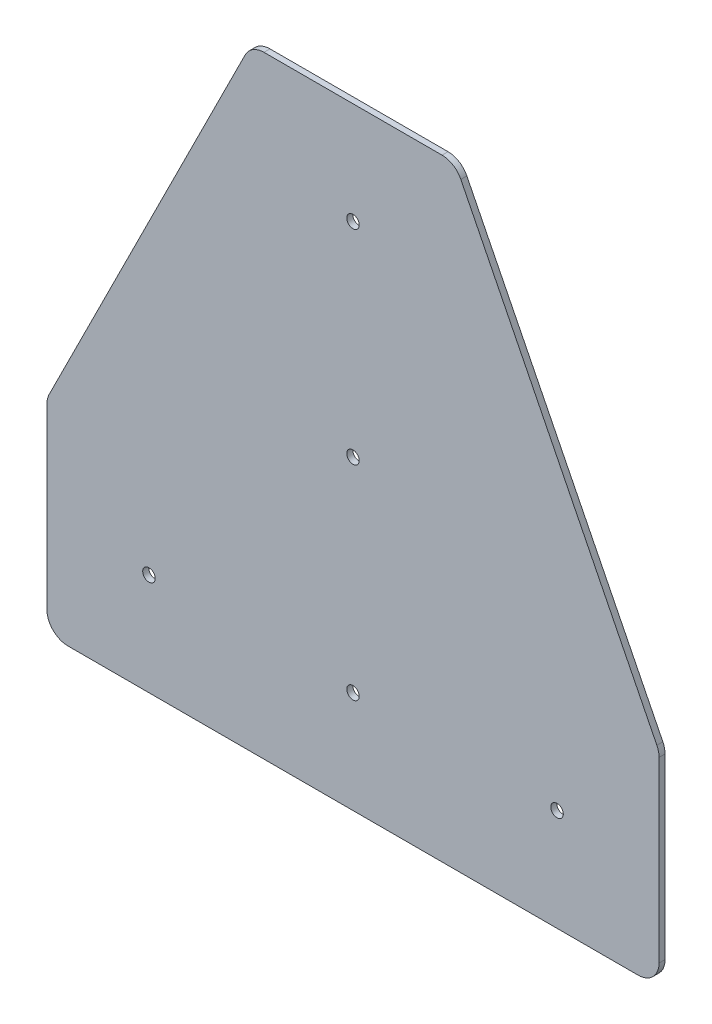
ISO-10303-21;
HEADER;
FILE_DESCRIPTION(('STEP AP214'),'2;1');
FILE_NAME('part.step','',(''),(''),'','','');
FILE_SCHEMA(('AUTOMOTIVE_DESIGN { 1 0 10303 214 1 1 1 1 }'));
ENDSEC;
DATA;
#1=APPLICATION_CONTEXT('core data for automotive mechanical design processes');
#2=APPLICATION_PROTOCOL_DEFINITION('international standard','automotive_design',2000,#1);
#3=PRODUCT_CONTEXT('',#1,'mechanical');
#4=PRODUCT('Part','Part','',(#3));
#5=PRODUCT_RELATED_PRODUCT_CATEGORY('part','',(#4));
#6=PRODUCT_DEFINITION_FORMATION('','',#4);
#7=PRODUCT_DEFINITION_CONTEXT('part definition',#1,'design');
#8=PRODUCT_DEFINITION('design','',#6,#7);
#9=PRODUCT_DEFINITION_SHAPE('','',#8);
#10=(LENGTH_UNIT() NAMED_UNIT(*) SI_UNIT(.MILLI.,.METRE.));
#11=(NAMED_UNIT(*) PLANE_ANGLE_UNIT() SI_UNIT($,.RADIAN.));
#12=(NAMED_UNIT(*) SI_UNIT($,.STERADIAN.) SOLID_ANGLE_UNIT());
#13=UNCERTAINTY_MEASURE_WITH_UNIT(LENGTH_MEASURE(1.E-05),#10,'distance_accuracy_value','');
#14=(GEOMETRIC_REPRESENTATION_CONTEXT(3) GLOBAL_UNCERTAINTY_ASSIGNED_CONTEXT((#13)) GLOBAL_UNIT_ASSIGNED_CONTEXT((#10,
#11,#12)) REPRESENTATION_CONTEXT('',''));
#15=CARTESIAN_POINT('',(0.,0.,0.));
#16=DIRECTION('',(0.,0.,1.));
#17=DIRECTION('',(1.,0.,0.));
#18=AXIS2_PLACEMENT_3D('',#15,#16,#17);
#19=CARTESIAN_POINT('',(-75.40625,0.,0.));
#20=DIRECTION('',(0.,1.,0.));
#21=DIRECTION('',(0.,0.,1.));
#22=AXIS2_PLACEMENT_3D('',#19,#20,#21);
#23=PLANE('',#22);
#24=DIRECTION('',(0.,0.,-1.));
#25=VECTOR('',#24,1.);
#26=CARTESIAN_POINT('',(75.4062500021374,0.,0.79375));
#27=LINE('',#26,#25);
#28=CARTESIAN_POINT('',(75.4062500010687,0.,0.));
#29=VERTEX_POINT('',#28);
#30=CARTESIAN_POINT('',(75.4062500010687,0.,1.5875));
#31=VERTEX_POINT('',#30);
#32=EDGE_CURVE('E160',#29,#31,#27,.F.);
#33=ORIENTED_EDGE('',*,*,#32,.T.);
#34=DIRECTION('',(1.,0.,0.));
#35=VECTOR('',#34,1.);
#36=CARTESIAN_POINT('',(0.,0.,1.5875));
#37=LINE('',#36,#35);
#38=CARTESIAN_POINT('',(-75.4062499989313,0.,1.5875));
#39=VERTEX_POINT('',#38);
#40=EDGE_CURVE('E194',#39,#31,#37,.T.);
#41=ORIENTED_EDGE('',*,*,#40,.F.);
#42=DIRECTION('',(0.,0.,1.));
#43=VECTOR('',#42,1.);
#44=CARTESIAN_POINT('',(-75.4062499978626,0.,0.79375));
#45=LINE('',#44,#43);
#46=CARTESIAN_POINT('',(-75.4062499989313,0.,0.));
#47=VERTEX_POINT('',#46);
#48=EDGE_CURVE('E130',#39,#47,#45,.F.);
#49=ORIENTED_EDGE('',*,*,#48,.T.);
#50=DIRECTION('',(1.,0.,0.));
#51=VECTOR('',#50,1.);
#52=CARTESIAN_POINT('',(0.,0.,0.));
#53=LINE('',#52,#51);
#54=EDGE_CURVE('E211',#47,#29,#53,.T.);
#55=ORIENTED_EDGE('',*,*,#54,.T.);
#56=EDGE_LOOP('',(#33,#41,#49,#55));
#57=FACE_BOUND('',#56,.T.);
#58=ADVANCED_FACE('F16',(#57),#23,.F.);
#59=CARTESIAN_POINT('',(75.40625,5.55625,1.5875));
#60=DIRECTION('',(0.,0.,-1.));
#61=DIRECTION('',(0.,1.,0.));
#62=AXIS2_PLACEMENT_3D('',#59,#60,#61);
#63=CYLINDRICAL_SURFACE('',#62,5.55625);
#64=ORIENTED_EDGE('',*,*,#32,.F.);
#65=CARTESIAN_POINT('',(75.40625,5.55625,0.));
#66=DIRECTION('',(0.,0.,-1.));
#67=DIRECTION('',(0.,1.,0.));
#68=AXIS2_PLACEMENT_3D('',#65,#66,#67);
#69=CIRCLE('',#68,5.55625);
#70=CARTESIAN_POINT('',(80.9625,5.55625,0.));
#71=VERTEX_POINT('',#70);
#72=EDGE_CURVE('E208',#29,#71,#69,.F.);
#73=ORIENTED_EDGE('',*,*,#72,.T.);
#74=DIRECTION('',(0.,0.,1.));
#75=VECTOR('',#74,1.);
#76=CARTESIAN_POINT('',(80.9625,5.55625,0.79375));
#77=LINE('',#76,#75);
#78=CARTESIAN_POINT('',(80.9625,5.55625,1.5875));
#79=VERTEX_POINT('',#78);
#80=EDGE_CURVE('E157',#71,#79,#77,.T.);
#81=ORIENTED_EDGE('',*,*,#80,.T.);
#82=CARTESIAN_POINT('',(75.40625,5.55625,1.5875));
#83=DIRECTION('',(0.,0.,-1.));
#84=DIRECTION('',(0.,1.,0.));
#85=AXIS2_PLACEMENT_3D('',#82,#83,#84);
#86=CIRCLE('',#85,5.55625);
#87=EDGE_CURVE('E192',#31,#79,#86,.F.);
#88=ORIENTED_EDGE('',*,*,#87,.F.);
#89=EDGE_LOOP('',(#64,#73,#81,#88));
#90=FACE_BOUND('',#89,.T.);
#91=ADVANCED_FACE('F301',(#90),#63,.T.);
#92=CARTESIAN_POINT('',(80.9625,5.55625,0.));
#93=DIRECTION('',(-1.,0.,0.));
#94=DIRECTION('',(0.,0.,1.));
#95=AXIS2_PLACEMENT_3D('',#92,#93,#94);
#96=PLANE('',#95);
#97=ORIENTED_EDGE('',*,*,#80,.F.);
#98=DIRECTION('',(0.,1.,0.));
#99=VECTOR('',#98,1.);
#100=CARTESIAN_POINT('',(80.9625,80.9625,0.));
#101=LINE('',#100,#99);
#102=CARTESIAN_POINT('',(80.9625,52.6633473008604,0.));
#103=VERTEX_POINT('',#102);
#104=EDGE_CURVE('E207',#71,#103,#101,.T.);
#105=ORIENTED_EDGE('',*,*,#104,.T.);
#106=DIRECTION('',(0.,0.,-1.));
#107=VECTOR('',#106,1.);
#108=CARTESIAN_POINT('',(80.9625,52.6633472997208,0.79375));
#109=LINE('',#108,#107);
#110=CARTESIAN_POINT('',(80.9625,52.6633473008604,1.5875));
#111=VERTEX_POINT('',#110);
#112=EDGE_CURVE('E104',#103,#111,#109,.F.);
#113=ORIENTED_EDGE('',*,*,#112,.T.);
#114=DIRECTION('',(0.,1.,0.));
#115=VECTOR('',#114,1.);
#116=CARTESIAN_POINT('',(80.9625,80.9625,1.5875));
#117=LINE('',#116,#115);
#118=EDGE_CURVE('E191',#79,#111,#117,.T.);
#119=ORIENTED_EDGE('',*,*,#118,.F.);
#120=EDGE_LOOP('',(#97,#105,#113,#119));
#121=FACE_BOUND('',#120,.T.);
#122=ADVANCED_FACE('F300',(#121),#96,.F.);
#123=CARTESIAN_POINT('',(75.40625,52.663347302,1.5875));
#124=DIRECTION('',(0.,0.,-1.));
#125=DIRECTION('',(0.,1.,0.));
#126=AXIS2_PLACEMENT_3D('',#123,#124,#125);
#127=CYLINDRICAL_SURFACE('',#126,5.55625);
#128=ORIENTED_EDGE('',*,*,#112,.F.);
#129=CARTESIAN_POINT('',(75.40625,52.663347302,0.));
#130=DIRECTION('',(0.,0.,-1.));
#131=DIRECTION('',(0.,1.,0.));
#132=AXIS2_PLACEMENT_3D('',#129,#130,#131);
#133=CIRCLE('',#132,5.55625);
#134=CARTESIAN_POINT('',(80.3759110792,55.1481778416,0.));
#135=VERTEX_POINT('',#134);
#136=EDGE_CURVE('E20',#103,#135,#133,.F.);
#137=ORIENTED_EDGE('',*,*,#136,.T.);
#138=DIRECTION('',(0.,0.,1.));
#139=VECTOR('',#138,1.);
#140=CARTESIAN_POINT('',(80.3759110792,55.1481778416,0.79375));
#141=LINE('',#140,#139);
#142=CARTESIAN_POINT('',(80.3759111000141,55.1481778539469,1.5875));
#143=VERTEX_POINT('',#142);
#144=EDGE_CURVE('E111',#135,#143,#141,.T.);
#145=ORIENTED_EDGE('',*,*,#144,.T.);
#146=CARTESIAN_POINT('',(75.40625,52.663347302,1.5875));
#147=DIRECTION('',(0.,0.,-1.));
#148=DIRECTION('',(0.,1.,0.));
#149=AXIS2_PLACEMENT_3D('',#146,#147,#148);
#150=CIRCLE('',#149,5.55625);
#151=EDGE_CURVE('E189',#111,#143,#150,.F.);
#152=ORIENTED_EDGE('',*,*,#151,.F.);
#153=EDGE_LOOP('',(#128,#137,#145,#152));
#154=FACE_BOUND('',#153,.T.);
#155=ADVANCED_FACE('F128',(#154),#127,.T.);
#156=CARTESIAN_POINT('',(28.5232097302,158.8535805396,0.));
#157=DIRECTION('',(-0.894427190999916,-0.447213595499958,0.));
#158=DIRECTION('',(0.447213595499958,-0.894427190999916,0.));
#159=AXIS2_PLACEMENT_3D('',#156,#157,#158);
#160=PLANE('',#159);
#161=ORIENTED_EDGE('',*,*,#144,.F.);
#162=DIRECTION('',(0.447213595499958,-0.894427190999916,0.));
#163=VECTOR('',#162,1.);
#164=CARTESIAN_POINT('',(28.5232097302,158.8535805396,0.));
#165=LINE('',#164,#163);
#166=CARTESIAN_POINT('',(28.5232097311073,158.853580538777,0.));
#167=VERTEX_POINT('',#166);
#168=EDGE_CURVE('E115',#135,#167,#165,.F.);
#169=ORIENTED_EDGE('',*,*,#168,.T.);
#170=DIRECTION('',(0.,0.,-1.));
#171=VECTOR('',#170,1.);
#172=CARTESIAN_POINT('',(28.5232097320146,158.853580537954,0.79375));
#173=LINE('',#172,#171);
#174=CARTESIAN_POINT('',(28.5232097195363,158.853580534931,1.5875));
#175=VERTEX_POINT('',#174);
#176=EDGE_CURVE('E117',#167,#175,#173,.F.);
#177=ORIENTED_EDGE('',*,*,#176,.T.);
#178=DIRECTION('',(-0.447213596058579,0.894427190720605,0.));
#179=VECTOR('',#178,1.);
#180=CARTESIAN_POINT('',(80.3759111427,55.14817782255,1.5875));
#181=LINE('',#180,#179);
#182=EDGE_CURVE('E116',#143,#175,#181,.T.);
#183=ORIENTED_EDGE('',*,*,#182,.F.);
#184=EDGE_LOOP('',(#161,#169,#177,#183));
#185=FACE_BOUND('',#184,.T.);
#186=ADVANCED_FACE('F113',(#185),#160,.F.);
#187=CARTESIAN_POINT('',(23.553548651,156.36875,1.5875));
#188=DIRECTION('',(0.,0.,-1.));
#189=DIRECTION('',(0.,1.,0.));
#190=AXIS2_PLACEMENT_3D('',#187,#188,#189);
#191=CYLINDRICAL_SURFACE('',#190,5.55625);
#192=ORIENTED_EDGE('',*,*,#176,.F.);
#193=CARTESIAN_POINT('',(23.553548651,156.36875,0.));
#194=DIRECTION('',(0.,0.,-1.));
#195=DIRECTION('',(0.,1.,0.));
#196=AXIS2_PLACEMENT_3D('',#193,#194,#195);
#197=CIRCLE('',#196,5.55625);
#198=CARTESIAN_POINT('',(23.553548651,161.925,0.));
#199=VERTEX_POINT('',#198);
#200=EDGE_CURVE('E127',#167,#199,#197,.F.);
#201=ORIENTED_EDGE('',*,*,#200,.T.);
#202=DIRECTION('',(0.,0.,1.));
#203=VECTOR('',#202,1.);
#204=CARTESIAN_POINT('',(23.553548651,161.925,0.79375));
#205=LINE('',#204,#203);
#206=CARTESIAN_POINT('',(23.553548651,161.925,1.5875));
#207=VERTEX_POINT('',#206);
#208=EDGE_CURVE('E152',#199,#207,#205,.T.);
#209=ORIENTED_EDGE('',*,*,#208,.T.);
#210=CARTESIAN_POINT('',(23.553548651,156.36875,1.5875));
#211=DIRECTION('',(0.,0.,-1.));
#212=DIRECTION('',(0.,1.,0.));
#213=AXIS2_PLACEMENT_3D('',#210,#211,#212);
#214=CIRCLE('',#213,5.55625);
#215=EDGE_CURVE('E186',#175,#207,#214,.F.);
#216=ORIENTED_EDGE('',*,*,#215,.F.);
#217=EDGE_LOOP('',(#192,#201,#209,#216));
#218=FACE_BOUND('',#217,.T.);
#219=ADVANCED_FACE('F295',(#218),#191,.T.);
#220=CARTESIAN_POINT('',(-23.553548651,161.925,1.5875));
#221=DIRECTION('',(0.,-1.,0.));
#222=DIRECTION('',(0.,0.,-1.));
#223=AXIS2_PLACEMENT_3D('',#220,#221,#222);
#224=PLANE('',#223);
#225=ORIENTED_EDGE('',*,*,#208,.F.);
#226=DIRECTION('',(-1.,0.,0.));
#227=VECTOR('',#226,1.);
#228=CARTESIAN_POINT('',(0.,161.925,0.));
#229=LINE('',#228,#227);
#230=CARTESIAN_POINT('',(-23.5535486504302,161.925,0.));
#231=VERTEX_POINT('',#230);
#232=EDGE_CURVE('E138',#199,#231,#229,.T.);
#233=ORIENTED_EDGE('',*,*,#232,.T.);
#234=DIRECTION('',(0.,0.,-1.));
#235=VECTOR('',#234,1.);
#236=CARTESIAN_POINT('',(-23.5535486498604,161.925,0.79375));
#237=LINE('',#236,#235);
#238=CARTESIAN_POINT('',(-23.5535486504302,161.925,1.5875));
#239=VERTEX_POINT('',#238);
#240=EDGE_CURVE('E149',#231,#239,#237,.F.);
#241=ORIENTED_EDGE('',*,*,#240,.T.);
#242=DIRECTION('',(-1.,0.,0.));
#243=VECTOR('',#242,1.);
#244=CARTESIAN_POINT('',(0.,161.925,1.5875));
#245=LINE('',#244,#243);
#246=EDGE_CURVE('E185',#207,#239,#245,.T.);
#247=ORIENTED_EDGE('',*,*,#246,.F.);
#248=EDGE_LOOP('',(#225,#233,#241,#247));
#249=FACE_BOUND('',#248,.T.);
#250=ADVANCED_FACE('F228',(#249),#224,.F.);
#251=CARTESIAN_POINT('',(-23.553548651,156.36875,1.5875));
#252=DIRECTION('',(0.,0.,-1.));
#253=DIRECTION('',(0.,1.,0.));
#254=AXIS2_PLACEMENT_3D('',#251,#252,#253);
#255=CYLINDRICAL_SURFACE('',#254,5.55625000000001);
#256=ORIENTED_EDGE('',*,*,#240,.F.);
#257=CARTESIAN_POINT('',(-23.553548651,156.36875,0.));
#258=DIRECTION('',(0.,0.,-1.));
#259=DIRECTION('',(0.,1.,0.));
#260=AXIS2_PLACEMENT_3D('',#257,#258,#259);
#261=CIRCLE('',#260,5.55625000000001);
#262=CARTESIAN_POINT('',(-28.5232097302,158.8535805396,0.));
#263=VERTEX_POINT('',#262);
#264=EDGE_CURVE('E222',#231,#263,#261,.F.);
#265=ORIENTED_EDGE('',*,*,#264,.T.);
#266=DIRECTION('',(0.,0.,1.));
#267=VECTOR('',#266,1.);
#268=CARTESIAN_POINT('',(-28.5232097302,158.8535805396,0.79375));
#269=LINE('',#268,#267);
#270=CARTESIAN_POINT('',(-28.523209718629,158.853580535754,1.5875));
#271=VERTEX_POINT('',#270);
#272=EDGE_CURVE('E146',#263,#271,#269,.T.);
#273=ORIENTED_EDGE('',*,*,#272,.T.);
#274=CARTESIAN_POINT('',(-23.553548651,156.36875,1.5875));
#275=DIRECTION('',(0.,0.,-1.));
#276=DIRECTION('',(0.,1.,0.));
#277=AXIS2_PLACEMENT_3D('',#274,#275,#276);
#278=CIRCLE('',#277,5.55625000000001);
#279=EDGE_CURVE('E183',#239,#271,#278,.F.);
#280=ORIENTED_EDGE('',*,*,#279,.F.);
#281=EDGE_LOOP('',(#256,#265,#273,#280));
#282=FACE_BOUND('',#281,.T.);
#283=ADVANCED_FACE('F235',(#282),#255,.T.);
#284=CARTESIAN_POINT('',(-80.3759110792,55.1481778416,0.));
#285=DIRECTION('',(0.894427190999916,-0.447213595499958,0.));
#286=DIRECTION('',(0.447213595499958,0.894427190999916,0.));
#287=AXIS2_PLACEMENT_3D('',#284,#285,#286);
#288=PLANE('',#287);
#289=ORIENTED_EDGE('',*,*,#272,.F.);
#290=DIRECTION('',(0.447213595499958,0.894427190999916,0.));
#291=VECTOR('',#290,1.);
#292=CARTESIAN_POINT('',(-80.3759110792,55.1481778416,0.));
#293=LINE('',#292,#291);
#294=CARTESIAN_POINT('',(-80.3759110795977,55.1481778417963,0.));
#295=VERTEX_POINT('',#294);
#296=EDGE_CURVE('E219',#263,#295,#293,.F.);
#297=ORIENTED_EDGE('',*,*,#296,.T.);
#298=DIRECTION('',(0.,0.,-1.));
#299=VECTOR('',#298,1.);
#300=CARTESIAN_POINT('',(-80.3759110799953,55.1481778419926,0.79375));
#301=LINE('',#300,#299);
#302=CARTESIAN_POINT('',(-80.3759111004117,55.1481778541432,1.5875));
#303=VERTEX_POINT('',#302);
#304=EDGE_CURVE('E143',#295,#303,#301,.F.);
#305=ORIENTED_EDGE('',*,*,#304,.T.);
#306=DIRECTION('',(-0.44721359605858,-0.894427190720605,0.));
#307=VECTOR('',#306,1.);
#308=CARTESIAN_POINT('',(-28.523209707975,158.853580530075,1.5875));
#309=LINE('',#308,#307);
#310=EDGE_CURVE('E181',#271,#303,#309,.T.);
#311=ORIENTED_EDGE('',*,*,#310,.F.);
#312=EDGE_LOOP('',(#289,#297,#305,#311));
#313=FACE_BOUND('',#312,.T.);
#314=ADVANCED_FACE('F253',(#313),#288,.F.);
#315=CARTESIAN_POINT('',(-75.40625,52.663347302,1.5875));
#316=DIRECTION('',(0.,0.,-1.));
#317=DIRECTION('',(0.,1.,0.));
#318=AXIS2_PLACEMENT_3D('',#315,#316,#317);
#319=CYLINDRICAL_SURFACE('',#318,5.55625000000001);
#320=ORIENTED_EDGE('',*,*,#304,.F.);
#321=CARTESIAN_POINT('',(-75.40625,52.663347302,0.));
#322=DIRECTION('',(0.,0.,-1.));
#323=DIRECTION('',(0.,1.,0.));
#324=AXIS2_PLACEMENT_3D('',#321,#322,#323);
#325=CIRCLE('',#324,5.55625000000001);
#326=CARTESIAN_POINT('',(-80.9625,52.663347302,0.));
#327=VERTEX_POINT('',#326);
#328=EDGE_CURVE('E216',#295,#327,#325,.F.);
#329=ORIENTED_EDGE('',*,*,#328,.T.);
#330=DIRECTION('',(0.,0.,1.));
#331=VECTOR('',#330,1.);
#332=CARTESIAN_POINT('',(-80.9625,52.663347302,0.79375));
#333=LINE('',#332,#331);
#334=CARTESIAN_POINT('',(-80.9625,52.663347302,1.5875));
#335=VERTEX_POINT('',#334);
#336=EDGE_CURVE('E135',#327,#335,#333,.T.);
#337=ORIENTED_EDGE('',*,*,#336,.T.);
#338=CARTESIAN_POINT('',(-75.40625,52.663347302,1.5875));
#339=DIRECTION('',(0.,0.,-1.));
#340=DIRECTION('',(0.,1.,0.));
#341=AXIS2_PLACEMENT_3D('',#338,#339,#340);
#342=CIRCLE('',#341,5.55625000000001);
#343=EDGE_CURVE('E179',#303,#335,#342,.F.);
#344=ORIENTED_EDGE('',*,*,#343,.F.);
#345=EDGE_LOOP('',(#320,#329,#337,#344));
#346=FACE_BOUND('',#345,.T.);
#347=ADVANCED_FACE('F250',(#346),#319,.T.);
#348=CARTESIAN_POINT('',(-80.9625,5.55625,1.5875));
#349=DIRECTION('',(1.,0.,0.));
#350=DIRECTION('',(0.,0.,-1.));
#351=AXIS2_PLACEMENT_3D('',#348,#349,#350);
#352=PLANE('',#351);
#353=DIRECTION('',(0.,0.,-1.));
#354=VECTOR('',#353,1.);
#355=CARTESIAN_POINT('',(-80.9625,5.55624999900217,0.79375));
#356=LINE('',#355,#354);
#357=CARTESIAN_POINT('',(-80.9625,5.55624999950109,0.));
#358=VERTEX_POINT('',#357);
#359=CARTESIAN_POINT('',(-80.9625,5.55624999950109,1.5875));
#360=VERTEX_POINT('',#359);
#361=EDGE_CURVE('E129',#358,#360,#356,.F.);
#362=ORIENTED_EDGE('',*,*,#361,.T.);
#363=DIRECTION('',(0.,-1.,0.));
#364=VECTOR('',#363,1.);
#365=CARTESIAN_POINT('',(-80.9625,80.9625,1.5875));
#366=LINE('',#365,#364);
#367=EDGE_CURVE('E35',#335,#360,#366,.T.);
#368=ORIENTED_EDGE('',*,*,#367,.F.);
#369=ORIENTED_EDGE('',*,*,#336,.F.);
#370=DIRECTION('',(0.,-1.,0.));
#371=VECTOR('',#370,1.);
#372=CARTESIAN_POINT('',(-80.9625,80.9625,0.));
#373=LINE('',#372,#371);
#374=EDGE_CURVE('E215',#327,#358,#373,.T.);
#375=ORIENTED_EDGE('',*,*,#374,.T.);
#376=EDGE_LOOP('',(#362,#368,#369,#375));
#377=FACE_BOUND('',#376,.T.);
#378=ADVANCED_FACE('F246',(#377),#352,.F.);
#379=CARTESIAN_POINT('',(-75.40625,5.55625,1.5875));
#380=DIRECTION('',(0.,0.,-1.));
#381=DIRECTION('',(0.,1.,0.));
#382=AXIS2_PLACEMENT_3D('',#379,#380,#381);
#383=CYLINDRICAL_SURFACE('',#382,5.55625000000001);
#384=ORIENTED_EDGE('',*,*,#361,.F.);
#385=CARTESIAN_POINT('',(-75.40625,5.55625,0.));
#386=DIRECTION('',(0.,0.,-1.));
#387=DIRECTION('',(0.,1.,0.));
#388=AXIS2_PLACEMENT_3D('',#385,#386,#387);
#389=CIRCLE('',#388,5.55625000000001);
#390=EDGE_CURVE('E212',#358,#47,#389,.F.);
#391=ORIENTED_EDGE('',*,*,#390,.T.);
#392=ORIENTED_EDGE('',*,*,#48,.F.);
#393=CARTESIAN_POINT('',(-75.40625,5.55625,1.5875));
#394=DIRECTION('',(0.,0.,-1.));
#395=DIRECTION('',(0.,1.,0.));
#396=AXIS2_PLACEMENT_3D('',#393,#394,#395);
#397=CIRCLE('',#396,5.55625000000001);
#398=EDGE_CURVE('E177',#360,#39,#397,.F.);
#399=ORIENTED_EDGE('',*,*,#398,.F.);
#400=EDGE_LOOP('',(#384,#391,#392,#399));
#401=FACE_BOUND('',#400,.T.);
#402=ADVANCED_FACE('F290',(#401),#383,.T.);
#403=CARTESIAN_POINT('',(-53.975,26.9875,0.));
#404=DIRECTION('',(0.,0.,1.));
#405=DIRECTION('',(1.,0.,0.));
#406=AXIS2_PLACEMENT_3D('',#403,#404,#405);
#407=CYLINDRICAL_SURFACE('',#406,1.65099999999999);
#408=CARTESIAN_POINT('',(-53.975,26.9875,1.5875));
#409=DIRECTION('',(0.,0.,1.));
#410=DIRECTION('',(1.,0.,0.));
#411=AXIS2_PLACEMENT_3D('',#408,#409,#410);
#412=CIRCLE('',#411,1.65099999999999);
#413=CARTESIAN_POINT('',(-52.324,26.9875,1.5875));
#414=VERTEX_POINT('',#413);
#415=EDGE_CURVE('E174',#414,#414,#412,.F.);
#416=ORIENTED_EDGE('',*,*,#415,.F.);
#417=EDGE_LOOP('',(#416));
#418=FACE_BOUND('',#417,.T.);
#419=CARTESIAN_POINT('',(-53.975,26.9875,0.));
#420=DIRECTION('',(0.,0.,1.));
#421=DIRECTION('',(1.,0.,0.));
#422=AXIS2_PLACEMENT_3D('',#419,#420,#421);
#423=CIRCLE('',#422,1.65099999999999);
#424=CARTESIAN_POINT('',(-52.324,26.9875,0.));
#425=VERTEX_POINT('',#424);
#426=EDGE_CURVE('E204',#425,#425,#423,.F.);
#427=ORIENTED_EDGE('',*,*,#426,.T.);
#428=EDGE_LOOP('',(#427));
#429=FACE_BOUND('',#428,.T.);
#430=ADVANCED_FACE('F286',(#418,#429),#407,.F.);
#431=CARTESIAN_POINT('',(53.975,26.9875,0.));
#432=DIRECTION('',(0.,0.,1.));
#433=DIRECTION('',(1.,0.,0.));
#434=AXIS2_PLACEMENT_3D('',#431,#432,#433);
#435=CYLINDRICAL_SURFACE('',#434,1.651);
#436=CARTESIAN_POINT('',(53.975,26.9875,1.5875));
#437=DIRECTION('',(0.,0.,1.));
#438=DIRECTION('',(1.,0.,0.));
#439=AXIS2_PLACEMENT_3D('',#436,#437,#438);
#440=CIRCLE('',#439,1.651);
#441=CARTESIAN_POINT('',(55.626,26.9875,1.5875));
#442=VERTEX_POINT('',#441);
#443=EDGE_CURVE('E171',#442,#442,#440,.F.);
#444=ORIENTED_EDGE('',*,*,#443,.F.);
#445=EDGE_LOOP('',(#444));
#446=FACE_BOUND('',#445,.T.);
#447=CARTESIAN_POINT('',(53.975,26.9875,0.));
#448=DIRECTION('',(0.,0.,1.));
#449=DIRECTION('',(1.,0.,0.));
#450=AXIS2_PLACEMENT_3D('',#447,#448,#449);
#451=CIRCLE('',#450,1.651);
#452=CARTESIAN_POINT('',(55.626,26.9875,0.));
#453=VERTEX_POINT('',#452);
#454=EDGE_CURVE('E201',#453,#453,#451,.F.);
#455=ORIENTED_EDGE('',*,*,#454,.T.);
#456=EDGE_LOOP('',(#455));
#457=FACE_BOUND('',#456,.T.);
#458=ADVANCED_FACE('F282',(#446,#457),#435,.F.);
#459=CARTESIAN_POINT('',(0.,26.9875,0.));
#460=DIRECTION('',(0.,0.,1.));
#461=DIRECTION('',(1.,0.,0.));
#462=AXIS2_PLACEMENT_3D('',#459,#460,#461);
#463=CYLINDRICAL_SURFACE('',#462,1.651);
#464=CARTESIAN_POINT('',(0.,26.9875,1.5875));
#465=DIRECTION('',(0.,0.,1.));
#466=DIRECTION('',(1.,0.,0.));
#467=AXIS2_PLACEMENT_3D('',#464,#465,#466);
#468=CIRCLE('',#467,1.651);
#469=CARTESIAN_POINT('',(1.651,26.9875,1.5875));
#470=VERTEX_POINT('',#469);
#471=EDGE_CURVE('E168',#470,#470,#468,.F.);
#472=ORIENTED_EDGE('',*,*,#471,.F.);
#473=EDGE_LOOP('',(#472));
#474=FACE_BOUND('',#473,.T.);
#475=CARTESIAN_POINT('',(0.,26.9875,0.));
#476=DIRECTION('',(0.,0.,1.));
#477=DIRECTION('',(1.,0.,0.));
#478=AXIS2_PLACEMENT_3D('',#475,#476,#477);
#479=CIRCLE('',#478,1.651);
#480=CARTESIAN_POINT('',(1.651,26.9875,0.));
#481=VERTEX_POINT('',#480);
#482=EDGE_CURVE('E198',#481,#481,#479,.F.);
#483=ORIENTED_EDGE('',*,*,#482,.T.);
#484=EDGE_LOOP('',(#483));
#485=FACE_BOUND('',#484,.T.);
#486=ADVANCED_FACE('F278',(#474,#485),#463,.F.);
#487=CARTESIAN_POINT('',(0.,134.9375,0.));
#488=DIRECTION('',(0.,0.,1.));
#489=DIRECTION('',(1.,0.,0.));
#490=AXIS2_PLACEMENT_3D('',#487,#488,#489);
#491=CYLINDRICAL_SURFACE('',#490,1.651);
#492=CARTESIAN_POINT('',(0.,134.9375,1.5875));
#493=DIRECTION('',(0.,0.,1.));
#494=DIRECTION('',(1.,0.,0.));
#495=AXIS2_PLACEMENT_3D('',#492,#493,#494);
#496=CIRCLE('',#495,1.651);
#497=CARTESIAN_POINT('',(1.651,134.9375,1.5875));
#498=VERTEX_POINT('',#497);
#499=EDGE_CURVE('E165',#498,#498,#496,.F.);
#500=ORIENTED_EDGE('',*,*,#499,.F.);
#501=EDGE_LOOP('',(#500));
#502=FACE_BOUND('',#501,.T.);
#503=CARTESIAN_POINT('',(0.,134.9375,0.));
#504=DIRECTION('',(0.,0.,1.));
#505=DIRECTION('',(1.,0.,0.));
#506=AXIS2_PLACEMENT_3D('',#503,#504,#505);
#507=CIRCLE('',#506,1.651);
#508=CARTESIAN_POINT('',(1.651,134.9375,0.));
#509=VERTEX_POINT('',#508);
#510=EDGE_CURVE('E195',#509,#509,#507,.F.);
#511=ORIENTED_EDGE('',*,*,#510,.T.);
#512=EDGE_LOOP('',(#511));
#513=FACE_BOUND('',#512,.T.);
#514=ADVANCED_FACE('F275',(#502,#513),#491,.F.);
#515=CARTESIAN_POINT('',(-80.9625,0.,0.));
#516=DIRECTION('',(0.,0.,1.));
#517=DIRECTION('',(1.,0.,0.));
#518=AXIS2_PLACEMENT_3D('',#515,#516,#517);
#519=PLANE('',#518);
#520=ORIENTED_EDGE('',*,*,#510,.F.);
#521=EDGE_LOOP('',(#520));
#522=FACE_BOUND('',#521,.T.);
#523=ORIENTED_EDGE('',*,*,#482,.F.);
#524=EDGE_LOOP('',(#523));
#525=FACE_BOUND('',#524,.T.);
#526=ORIENTED_EDGE('',*,*,#454,.F.);
#527=EDGE_LOOP('',(#526));
#528=FACE_BOUND('',#527,.T.);
#529=ORIENTED_EDGE('',*,*,#426,.F.);
#530=EDGE_LOOP('',(#529));
#531=FACE_BOUND('',#530,.T.);
#532=CARTESIAN_POINT('',(0.,80.9625,0.));
#533=DIRECTION('',(0.,0.,1.));
#534=DIRECTION('',(1.,0.,0.));
#535=AXIS2_PLACEMENT_3D('',#532,#533,#534);
#536=CIRCLE('',#535,1.651);
#537=CARTESIAN_POINT('',(1.651,80.9625,0.));
#538=VERTEX_POINT('',#537);
#539=EDGE_CURVE('E26',#538,#538,#536,.F.);
#540=ORIENTED_EDGE('',*,*,#539,.F.);
#541=EDGE_LOOP('',(#540));
#542=FACE_BOUND('',#541,.T.);
#543=ORIENTED_EDGE('',*,*,#72,.F.);
#544=ORIENTED_EDGE('',*,*,#54,.F.);
#545=ORIENTED_EDGE('',*,*,#390,.F.);
#546=ORIENTED_EDGE('',*,*,#374,.F.);
#547=ORIENTED_EDGE('',*,*,#328,.F.);
#548=ORIENTED_EDGE('',*,*,#296,.F.);
#549=ORIENTED_EDGE('',*,*,#264,.F.);
#550=ORIENTED_EDGE('',*,*,#232,.F.);
#551=ORIENTED_EDGE('',*,*,#200,.F.);
#552=ORIENTED_EDGE('',*,*,#168,.F.);
#553=ORIENTED_EDGE('',*,*,#136,.F.);
#554=ORIENTED_EDGE('',*,*,#104,.F.);
#555=EDGE_LOOP('',(#543,#544,#545,#546,#547,#548,#549,#550,#551,#552,#553,#554));
#556=FACE_BOUND('',#555,.T.);
#557=ADVANCED_FACE('F122',(#522,#525,#528,#531,#542,#556),#519,.F.);
#558=CARTESIAN_POINT('',(-80.9625,0.,1.5875));
#559=DIRECTION('',(0.,0.,1.));
#560=DIRECTION('',(1.,0.,0.));
#561=AXIS2_PLACEMENT_3D('',#558,#559,#560);
#562=PLANE('',#561);
#563=ORIENTED_EDGE('',*,*,#499,.T.);
#564=EDGE_LOOP('',(#563));
#565=FACE_BOUND('',#564,.T.);
#566=ORIENTED_EDGE('',*,*,#471,.T.);
#567=EDGE_LOOP('',(#566));
#568=FACE_BOUND('',#567,.T.);
#569=ORIENTED_EDGE('',*,*,#443,.T.);
#570=EDGE_LOOP('',(#569));
#571=FACE_BOUND('',#570,.T.);
#572=ORIENTED_EDGE('',*,*,#415,.T.);
#573=EDGE_LOOP('',(#572));
#574=FACE_BOUND('',#573,.T.);
#575=CARTESIAN_POINT('',(0.,80.9625,1.5875));
#576=DIRECTION('',(0.,0.,1.));
#577=DIRECTION('',(1.,0.,0.));
#578=AXIS2_PLACEMENT_3D('',#575,#576,#577);
#579=CIRCLE('',#578,1.651);
#580=CARTESIAN_POINT('',(1.651,80.9625,1.5875));
#581=VERTEX_POINT('',#580);
#582=EDGE_CURVE('E11',#581,#581,#579,.T.);
#583=ORIENTED_EDGE('',*,*,#582,.F.);
#584=EDGE_LOOP('',(#583));
#585=FACE_BOUND('',#584,.T.);
#586=ORIENTED_EDGE('',*,*,#367,.T.);
#587=ORIENTED_EDGE('',*,*,#398,.T.);
#588=ORIENTED_EDGE('',*,*,#40,.T.);
#589=ORIENTED_EDGE('',*,*,#87,.T.);
#590=ORIENTED_EDGE('',*,*,#118,.T.);
#591=ORIENTED_EDGE('',*,*,#151,.T.);
#592=ORIENTED_EDGE('',*,*,#182,.T.);
#593=ORIENTED_EDGE('',*,*,#215,.T.);
#594=ORIENTED_EDGE('',*,*,#246,.T.);
#595=ORIENTED_EDGE('',*,*,#279,.T.);
#596=ORIENTED_EDGE('',*,*,#310,.T.);
#597=ORIENTED_EDGE('',*,*,#343,.T.);
#598=EDGE_LOOP('',(#586,#587,#588,#589,#590,#591,#592,#593,#594,#595,#596,#597));
#599=FACE_BOUND('',#598,.T.);
#600=ADVANCED_FACE('F18',(#565,#568,#571,#574,#585,#599),#562,.T.);
#601=CARTESIAN_POINT('',(0.,80.9625,0.));
#602=DIRECTION('',(0.,0.,1.));
#603=DIRECTION('',(1.,0.,0.));
#604=AXIS2_PLACEMENT_3D('',#601,#602,#603);
#605=CYLINDRICAL_SURFACE('',#604,1.651);
#606=ORIENTED_EDGE('',*,*,#539,.T.);
#607=EDGE_LOOP('',(#606));
#608=FACE_BOUND('',#607,.T.);
#609=ORIENTED_EDGE('',*,*,#582,.T.);
#610=EDGE_LOOP('',(#609));
#611=FACE_BOUND('',#610,.T.);
#612=ADVANCED_FACE('F265',(#608,#611),#605,.F.);
#613=CLOSED_SHELL('',(#58,#91,#122,#155,#186,#219,#250,#283,#314,#347,#378,#402,#430,#458,#486,
#514,#557,#600,#612));
#614=MANIFOLD_SOLID_BREP('B1',#613);
#615=ADVANCED_BREP_SHAPE_REPRESENTATION('',(#18,#614),#14);
#616=SHAPE_DEFINITION_REPRESENTATION(#9,#615);
ENDSEC;
END-ISO-10303-21;
